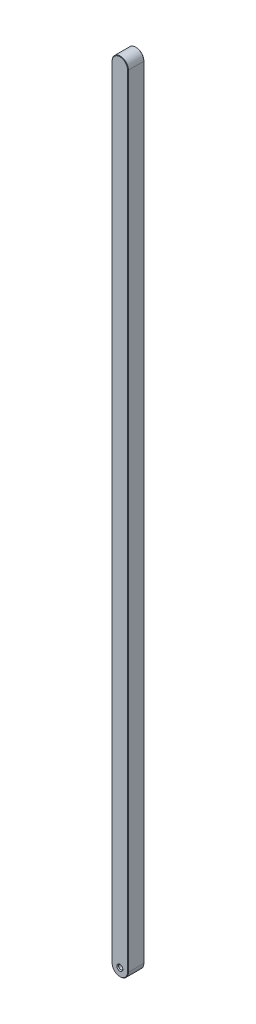
ISO-10303-21;
HEADER;
FILE_DESCRIPTION(('STEP AP214'),'2;1');
FILE_NAME('part.step','',(''),(''),'','','');
FILE_SCHEMA(('AUTOMOTIVE_DESIGN { 1 0 10303 214 1 1 1 1 }'));
ENDSEC;
DATA;
#1=APPLICATION_CONTEXT('core data for automotive mechanical design processes');
#2=APPLICATION_PROTOCOL_DEFINITION('international standard','automotive_design',2000,#1);
#3=PRODUCT_CONTEXT('',#1,'mechanical');
#4=PRODUCT('Part','Part','',(#3));
#5=PRODUCT_RELATED_PRODUCT_CATEGORY('part','',(#4));
#6=PRODUCT_DEFINITION_FORMATION('','',#4);
#7=PRODUCT_DEFINITION_CONTEXT('part definition',#1,'design');
#8=PRODUCT_DEFINITION('design','',#6,#7);
#9=PRODUCT_DEFINITION_SHAPE('','',#8);
#10=(LENGTH_UNIT() NAMED_UNIT(*) SI_UNIT(.MILLI.,.METRE.));
#11=(NAMED_UNIT(*) PLANE_ANGLE_UNIT() SI_UNIT($,.RADIAN.));
#12=(NAMED_UNIT(*) SI_UNIT($,.STERADIAN.) SOLID_ANGLE_UNIT());
#13=UNCERTAINTY_MEASURE_WITH_UNIT(LENGTH_MEASURE(1.E-05),#10,'distance_accuracy_value','');
#14=(GEOMETRIC_REPRESENTATION_CONTEXT(3) GLOBAL_UNCERTAINTY_ASSIGNED_CONTEXT((#13)) GLOBAL_UNIT_ASSIGNED_CONTEXT((#10,
#11,#12)) REPRESENTATION_CONTEXT('',''));
#15=CARTESIAN_POINT('',(0.,0.,0.));
#16=DIRECTION('',(0.,0.,1.));
#17=DIRECTION('',(1.,0.,0.));
#18=AXIS2_PLACEMENT_3D('',#15,#16,#17);
#19=CARTESIAN_POINT('',(0.,0.,4.7625));
#20=DIRECTION('',(0.,0.,-1.));
#21=DIRECTION('',(-1.,0.,0.));
#22=AXIS2_PLACEMENT_3D('',#19,#20,#21);
#23=CYLINDRICAL_SURFACE('',#22,4.7625);
#24=DIRECTION('',(0.,0.,-1.));
#25=VECTOR('',#24,1.);
#26=CARTESIAN_POINT('',(-4.7625,0.,4.7625));
#27=LINE('',#26,#25);
#28=CARTESIAN_POINT('',(-4.7625,0.,4.50850000000023));
#29=VERTEX_POINT('',#28);
#30=CARTESIAN_POINT('',(-4.7625,0.,-4.50849999999993));
#31=VERTEX_POINT('',#30);
#32=EDGE_CURVE('E129',#29,#31,#27,.T.);
#33=ORIENTED_EDGE('',*,*,#32,.T.);
#34=CARTESIAN_POINT('',(0.,0.,-4.50849999999993));
#35=DIRECTION('',(0.,0.,1.));
#36=DIRECTION('',(1.,0.,0.));
#37=AXIS2_PLACEMENT_3D('',#34,#35,#36);
#38=CIRCLE('',#37,4.7625);
#39=CARTESIAN_POINT('',(4.7625,0.,-4.50849999999993));
#40=VERTEX_POINT('',#39);
#41=EDGE_CURVE('E216',#31,#40,#38,.T.);
#42=ORIENTED_EDGE('',*,*,#41,.T.);
#43=DIRECTION('',(0.,0.,-1.));
#44=VECTOR('',#43,1.);
#45=CARTESIAN_POINT('',(4.7625,0.,4.7625));
#46=LINE('',#45,#44);
#47=CARTESIAN_POINT('',(4.7625,0.,4.50850000000023));
#48=VERTEX_POINT('',#47);
#49=EDGE_CURVE('E150',#48,#40,#46,.T.);
#50=ORIENTED_EDGE('',*,*,#49,.F.);
#51=CARTESIAN_POINT('',(0.,0.,4.50850000000023));
#52=DIRECTION('',(0.,0.,1.));
#53=DIRECTION('',(1.,0.,0.));
#54=AXIS2_PLACEMENT_3D('',#51,#52,#53);
#55=CIRCLE('',#54,4.7625);
#56=EDGE_CURVE('E214',#48,#29,#55,.F.);
#57=ORIENTED_EDGE('',*,*,#56,.T.);
#58=EDGE_LOOP('',(#33,#42,#50,#57));
#59=FACE_BOUND('',#58,.T.);
#60=ADVANCED_FACE('F53',(#59),#23,.T.);
#61=CARTESIAN_POINT('',(4.7625,0.,4.7625));
#62=DIRECTION('',(-1.,0.,0.));
#63=DIRECTION('',(0.,0.,1.));
#64=AXIS2_PLACEMENT_3D('',#61,#62,#63);
#65=PLANE('',#64);
#66=ORIENTED_EDGE('',*,*,#49,.T.);
#67=DIRECTION('',(0.,1.,0.));
#68=VECTOR('',#67,1.);
#69=CARTESIAN_POINT('',(4.7625,0.,-4.50849999999993));
#70=LINE('',#69,#68);
#71=CARTESIAN_POINT('',(4.7625,457.2,-4.50849999999993));
#72=VERTEX_POINT('',#71);
#73=EDGE_CURVE('E212',#40,#72,#70,.T.);
#74=ORIENTED_EDGE('',*,*,#73,.T.);
#75=DIRECTION('',(0.,0.,-1.));
#76=VECTOR('',#75,1.);
#77=CARTESIAN_POINT('',(4.7625,457.2,4.7625));
#78=LINE('',#77,#76);
#79=CARTESIAN_POINT('',(4.7625,457.2,4.50850000000023));
#80=VERTEX_POINT('',#79);
#81=EDGE_CURVE('E145',#80,#72,#78,.T.);
#82=ORIENTED_EDGE('',*,*,#81,.F.);
#83=DIRECTION('',(0.,-1.,0.));
#84=VECTOR('',#83,1.);
#85=CARTESIAN_POINT('',(4.7625,0.,4.50850000000023));
#86=LINE('',#85,#84);
#87=EDGE_CURVE('E210',#80,#48,#86,.T.);
#88=ORIENTED_EDGE('',*,*,#87,.T.);
#89=EDGE_LOOP('',(#66,#74,#82,#88));
#90=FACE_BOUND('',#89,.T.);
#91=ADVANCED_FACE('F228',(#90),#65,.F.);
#92=CARTESIAN_POINT('',(0.,457.2,4.7625));
#93=DIRECTION('',(0.,0.,-1.));
#94=DIRECTION('',(-1.,0.,0.));
#95=AXIS2_PLACEMENT_3D('',#92,#93,#94);
#96=CYLINDRICAL_SURFACE('',#95,4.7625);
#97=ORIENTED_EDGE('',*,*,#81,.T.);
#98=CARTESIAN_POINT('',(0.,457.2,-4.50849999999993));
#99=DIRECTION('',(0.,0.,1.));
#100=DIRECTION('',(1.,0.,0.));
#101=AXIS2_PLACEMENT_3D('',#98,#99,#100);
#102=CIRCLE('',#101,4.7625);
#103=CARTESIAN_POINT('',(-4.7625,457.2,-4.50849999999993));
#104=VERTEX_POINT('',#103);
#105=EDGE_CURVE('E144',#72,#104,#102,.T.);
#106=ORIENTED_EDGE('',*,*,#105,.T.);
#107=DIRECTION('',(0.,0.,-1.));
#108=VECTOR('',#107,1.);
#109=CARTESIAN_POINT('',(-4.7625,457.2,4.7625));
#110=LINE('',#109,#108);
#111=CARTESIAN_POINT('',(-4.7625,457.2,4.50850000000023));
#112=VERTEX_POINT('',#111);
#113=EDGE_CURVE('E127',#112,#104,#110,.T.);
#114=ORIENTED_EDGE('',*,*,#113,.F.);
#115=CARTESIAN_POINT('',(0.,457.2,4.50850000000023));
#116=DIRECTION('',(0.,0.,1.));
#117=DIRECTION('',(1.,0.,0.));
#118=AXIS2_PLACEMENT_3D('',#115,#116,#117);
#119=CIRCLE('',#118,4.7625);
#120=EDGE_CURVE('E141',#112,#80,#119,.F.);
#121=ORIENTED_EDGE('',*,*,#120,.T.);
#122=EDGE_LOOP('',(#97,#106,#114,#121));
#123=FACE_BOUND('',#122,.T.);
#124=ADVANCED_FACE('F140',(#123),#96,.T.);
#125=CARTESIAN_POINT('',(-4.7625,0.,4.7625));
#126=DIRECTION('',(1.,0.,0.));
#127=DIRECTION('',(0.,0.,-1.));
#128=AXIS2_PLACEMENT_3D('',#125,#126,#127);
#129=PLANE('',#128);
#130=ORIENTED_EDGE('',*,*,#113,.T.);
#131=DIRECTION('',(0.,-1.,0.));
#132=VECTOR('',#131,1.);
#133=CARTESIAN_POINT('',(-4.7625,0.,-4.50849999999993));
#134=LINE('',#133,#132);
#135=EDGE_CURVE('E133',#104,#31,#134,.T.);
#136=ORIENTED_EDGE('',*,*,#135,.T.);
#137=ORIENTED_EDGE('',*,*,#32,.F.);
#138=DIRECTION('',(0.,1.,0.));
#139=VECTOR('',#138,1.);
#140=CARTESIAN_POINT('',(-4.7625,457.2,4.50850000000023));
#141=LINE('',#140,#139);
#142=EDGE_CURVE('E124',#29,#112,#141,.T.);
#143=ORIENTED_EDGE('',*,*,#142,.T.);
#144=EDGE_LOOP('',(#130,#136,#137,#143));
#145=FACE_BOUND('',#144,.T.);
#146=ADVANCED_FACE('F126',(#145),#129,.F.);
#147=CARTESIAN_POINT('',(0.,0.,4.7625));
#148=DIRECTION('',(0.,0.,1.));
#149=DIRECTION('',(1.,0.,0.));
#150=AXIS2_PLACEMENT_3D('',#147,#148,#149);
#151=PLANE('',#150);
#152=DIRECTION('',(0.,1.,0.));
#153=VECTOR('',#152,1.);
#154=CARTESIAN_POINT('',(4.50850000000025,457.2,4.7625));
#155=LINE('',#154,#153);
#156=CARTESIAN_POINT('',(4.50850000000025,0.,4.7625));
#157=VERTEX_POINT('',#156);
#158=CARTESIAN_POINT('',(4.50850000000025,457.2,4.7625));
#159=VERTEX_POINT('',#158);
#160=EDGE_CURVE('E78',#157,#159,#155,.T.);
#161=ORIENTED_EDGE('',*,*,#160,.T.);
#162=CARTESIAN_POINT('',(0.,457.2,4.7625));
#163=DIRECTION('',(0.,0.,1.));
#164=DIRECTION('',(1.,0.,0.));
#165=AXIS2_PLACEMENT_3D('',#162,#163,#164);
#166=CIRCLE('',#165,4.50850000000025);
#167=CARTESIAN_POINT('',(-4.50850000000025,457.2,4.7625));
#168=VERTEX_POINT('',#167);
#169=EDGE_CURVE('E11',#159,#168,#166,.T.);
#170=ORIENTED_EDGE('',*,*,#169,.T.);
#171=DIRECTION('',(0.,-1.,0.));
#172=VECTOR('',#171,1.);
#173=CARTESIAN_POINT('',(-4.50850000000025,0.,4.7625));
#174=LINE('',#173,#172);
#175=CARTESIAN_POINT('',(-4.50850000000025,0.,4.7625));
#176=VERTEX_POINT('',#175);
#177=EDGE_CURVE('E63',#168,#176,#174,.T.);
#178=ORIENTED_EDGE('',*,*,#177,.T.);
#179=CARTESIAN_POINT('',(0.,0.,4.7625));
#180=DIRECTION('',(0.,0.,1.));
#181=DIRECTION('',(1.,0.,0.));
#182=AXIS2_PLACEMENT_3D('',#179,#180,#181);
#183=CIRCLE('',#182,4.50850000000025);
#184=EDGE_CURVE('E218',#176,#157,#183,.T.);
#185=ORIENTED_EDGE('',*,*,#184,.T.);
#186=EDGE_LOOP('',(#161,#170,#178,#185));
#187=FACE_BOUND('',#186,.T.);
#188=CARTESIAN_POINT('',(0.,0.,4.7625));
#189=DIRECTION('',(0.,0.,1.));
#190=DIRECTION('',(1.,0.,0.));
#191=AXIS2_PLACEMENT_3D('',#188,#189,#190);
#192=CIRCLE('',#191,1.75);
#193=CARTESIAN_POINT('',(1.75000000000001,0.,4.7625));
#194=VERTEX_POINT('',#193);
#195=EDGE_CURVE('E183',#194,#194,#192,.T.);
#196=ORIENTED_EDGE('',*,*,#195,.F.);
#197=EDGE_LOOP('',(#196));
#198=FACE_BOUND('',#197,.T.);
#199=ADVANCED_FACE('F221',(#187,#198),#151,.T.);
#200=CARTESIAN_POINT('',(0.,0.,-4.7625));
#201=DIRECTION('',(0.,0.,1.));
#202=DIRECTION('',(1.,0.,0.));
#203=AXIS2_PLACEMENT_3D('',#200,#201,#202);
#204=PLANE('',#203);
#205=DIRECTION('',(0.,1.,0.));
#206=VECTOR('',#205,1.);
#207=CARTESIAN_POINT('',(-4.50849999999986,0.,-4.7625));
#208=LINE('',#207,#206);
#209=CARTESIAN_POINT('',(-4.50849999999986,0.,-4.7625));
#210=VERTEX_POINT('',#209);
#211=CARTESIAN_POINT('',(-4.50849999999986,457.2,-4.7625));
#212=VERTEX_POINT('',#211);
#213=EDGE_CURVE('E205',#210,#212,#208,.T.);
#214=ORIENTED_EDGE('',*,*,#213,.T.);
#215=CARTESIAN_POINT('',(0.,457.2,-4.7625));
#216=DIRECTION('',(0.,0.,1.));
#217=DIRECTION('',(1.,0.,0.));
#218=AXIS2_PLACEMENT_3D('',#215,#216,#217);
#219=CIRCLE('',#218,4.50849999999986);
#220=CARTESIAN_POINT('',(4.50849999999986,457.2,-4.7625));
#221=VERTEX_POINT('',#220);
#222=EDGE_CURVE('E134',#212,#221,#219,.F.);
#223=ORIENTED_EDGE('',*,*,#222,.T.);
#224=DIRECTION('',(0.,-1.,0.));
#225=VECTOR('',#224,1.);
#226=CARTESIAN_POINT('',(4.50849999999986,0.,-4.7625));
#227=LINE('',#226,#225);
#228=CARTESIAN_POINT('',(4.50849999999986,0.,-4.7625));
#229=VERTEX_POINT('',#228);
#230=EDGE_CURVE('E203',#221,#229,#227,.T.);
#231=ORIENTED_EDGE('',*,*,#230,.T.);
#232=CARTESIAN_POINT('',(0.,0.,-4.7625));
#233=DIRECTION('',(0.,0.,1.));
#234=DIRECTION('',(1.,0.,0.));
#235=AXIS2_PLACEMENT_3D('',#232,#233,#234);
#236=CIRCLE('',#235,4.50849999999986);
#237=EDGE_CURVE('E201',#229,#210,#236,.F.);
#238=ORIENTED_EDGE('',*,*,#237,.T.);
#239=EDGE_LOOP('',(#214,#223,#231,#238));
#240=FACE_BOUND('',#239,.T.);
#241=CARTESIAN_POINT('',(0.,0.,-4.7625));
#242=DIRECTION('',(0.,0.,1.));
#243=DIRECTION('',(1.,0.,0.));
#244=AXIS2_PLACEMENT_3D('',#241,#242,#243);
#245=CIRCLE('',#244,1.75);
#246=CARTESIAN_POINT('',(1.75,0.,-4.7625));
#247=VERTEX_POINT('',#246);
#248=EDGE_CURVE('E177',#247,#247,#245,.T.);
#249=ORIENTED_EDGE('',*,*,#248,.T.);
#250=EDGE_LOOP('',(#249));
#251=FACE_BOUND('',#250,.T.);
#252=ADVANCED_FACE('F258',(#240,#251),#204,.F.);
#253=CARTESIAN_POINT('',(0.,0.,-4.2625));
#254=DIRECTION('',(0.,0.,-1.));
#255=DIRECTION('',(-1.,0.,0.));
#256=AXIS2_PLACEMENT_3D('',#253,#254,#255);
#257=CONICAL_SURFACE('',#256,1.25,0.785398163397447);
#258=ORIENTED_EDGE('',*,*,#248,.F.);
#259=EDGE_LOOP('',(#258));
#260=FACE_BOUND('',#259,.T.);
#261=CARTESIAN_POINT('',(0.,0.,-4.2625));
#262=DIRECTION('',(0.,0.,1.));
#263=DIRECTION('',(1.,0.,0.));
#264=AXIS2_PLACEMENT_3D('',#261,#262,#263);
#265=CIRCLE('',#264,1.25);
#266=CARTESIAN_POINT('',(1.25000000000001,0.,-4.2625));
#267=VERTEX_POINT('',#266);
#268=EDGE_CURVE('E193',#267,#267,#265,.T.);
#269=ORIENTED_EDGE('',*,*,#268,.T.);
#270=EDGE_LOOP('',(#269));
#271=FACE_BOUND('',#270,.T.);
#272=ADVANCED_FACE('F261',(#260,#271),#257,.F.);
#273=CARTESIAN_POINT('',(0.,0.,4.7625));
#274=DIRECTION('',(0.,0.,1.));
#275=DIRECTION('',(1.,0.,0.));
#276=AXIS2_PLACEMENT_3D('',#273,#274,#275);
#277=CYLINDRICAL_SURFACE('',#276,1.25);
#278=ORIENTED_EDGE('',*,*,#268,.F.);
#279=EDGE_LOOP('',(#278));
#280=FACE_BOUND('',#279,.T.);
#281=CARTESIAN_POINT('',(0.,0.,4.2625));
#282=DIRECTION('',(0.,0.,1.));
#283=DIRECTION('',(1.,0.,0.));
#284=AXIS2_PLACEMENT_3D('',#281,#282,#283);
#285=CIRCLE('',#284,1.25);
#286=CARTESIAN_POINT('',(1.25000000000001,0.,4.2625));
#287=VERTEX_POINT('',#286);
#288=EDGE_CURVE('E188',#287,#287,#285,.T.);
#289=ORIENTED_EDGE('',*,*,#288,.T.);
#290=EDGE_LOOP('',(#289));
#291=FACE_BOUND('',#290,.T.);
#292=ADVANCED_FACE('F267',(#280,#291),#277,.F.);
#293=CARTESIAN_POINT('',(0.,0.,4.7625));
#294=DIRECTION('',(0.,0.,1.));
#295=DIRECTION('',(1.,0.,0.));
#296=AXIS2_PLACEMENT_3D('',#293,#294,#295);
#297=CONICAL_SURFACE('',#296,1.75,0.785398163397447);
#298=ORIENTED_EDGE('',*,*,#288,.F.);
#299=EDGE_LOOP('',(#298));
#300=FACE_BOUND('',#299,.T.);
#301=ORIENTED_EDGE('',*,*,#195,.T.);
#302=EDGE_LOOP('',(#301));
#303=FACE_BOUND('',#302,.T.);
#304=ADVANCED_FACE('F271',(#300,#303),#297,.F.);
#305=CARTESIAN_POINT('',(0.,0.,-4.50849999999993));
#306=DIRECTION('',(0.,0.,1.));
#307=DIRECTION('',(1.,0.,0.));
#308=AXIS2_PLACEMENT_3D('',#305,#306,#307);
#309=CONICAL_SURFACE('',#308,4.7625,0.785398163397592);
#310=DIRECTION('',(-0.707106781186649,0.,0.707106781186446));
#311=VECTOR('',#310,1.);
#312=CARTESIAN_POINT('',(-4.50849999999986,0.,-4.7625));
#313=LINE('',#312,#311);
#314=EDGE_CURVE('E169',#210,#31,#313,.T.);
#315=ORIENTED_EDGE('',*,*,#314,.F.);
#316=ORIENTED_EDGE('',*,*,#237,.F.);
#317=DIRECTION('',(-0.707106781186649,0.,-0.707106781186446));
#318=VECTOR('',#317,1.);
#319=CARTESIAN_POINT('',(4.7625,0.,-4.50849999999993));
#320=LINE('',#319,#318);
#321=EDGE_CURVE('E157',#40,#229,#320,.T.);
#322=ORIENTED_EDGE('',*,*,#321,.F.);
#323=ORIENTED_EDGE('',*,*,#41,.F.);
#324=EDGE_LOOP('',(#315,#316,#322,#323));
#325=FACE_BOUND('',#324,.T.);
#326=ADVANCED_FACE('F232',(#325),#309,.T.);
#327=CARTESIAN_POINT('',(4.7625,0.,-4.50849999999993));
#328=DIRECTION('',(-0.707106781186446,0.,0.707106781186649));
#329=DIRECTION('',(0.,1.,0.));
#330=AXIS2_PLACEMENT_3D('',#327,#328,#329);
#331=PLANE('',#330);
#332=ORIENTED_EDGE('',*,*,#321,.T.);
#333=ORIENTED_EDGE('',*,*,#230,.F.);
#334=DIRECTION('',(-0.707106781186649,0.,-0.707106781186446));
#335=VECTOR('',#334,1.);
#336=CARTESIAN_POINT('',(4.7625,457.2,-4.50849999999993));
#337=LINE('',#336,#335);
#338=EDGE_CURVE('E163',#72,#221,#337,.T.);
#339=ORIENTED_EDGE('',*,*,#338,.F.);
#340=ORIENTED_EDGE('',*,*,#73,.F.);
#341=EDGE_LOOP('',(#332,#333,#339,#340));
#342=FACE_BOUND('',#341,.T.);
#343=ADVANCED_FACE('F235',(#342),#331,.F.);
#344=CARTESIAN_POINT('',(-4.7625,0.,-4.50849999999993));
#345=DIRECTION('',(0.707106781186446,0.,0.707106781186649));
#346=DIRECTION('',(0.,-1.,0.));
#347=AXIS2_PLACEMENT_3D('',#344,#345,#346);
#348=PLANE('',#347);
#349=ORIENTED_EDGE('',*,*,#314,.T.);
#350=ORIENTED_EDGE('',*,*,#135,.F.);
#351=DIRECTION('',(-0.707106781186649,0.,0.707106781186446));
#352=VECTOR('',#351,1.);
#353=CARTESIAN_POINT('',(-4.50849999999986,457.2,-4.7625));
#354=LINE('',#353,#352);
#355=EDGE_CURVE('E160',#212,#104,#354,.T.);
#356=ORIENTED_EDGE('',*,*,#355,.F.);
#357=ORIENTED_EDGE('',*,*,#213,.F.);
#358=EDGE_LOOP('',(#349,#350,#356,#357));
#359=FACE_BOUND('',#358,.T.);
#360=ADVANCED_FACE('F238',(#359),#348,.F.);
#361=CARTESIAN_POINT('',(0.,457.2,-4.50849999999993));
#362=DIRECTION('',(0.,0.,1.));
#363=DIRECTION('',(1.,0.,0.));
#364=AXIS2_PLACEMENT_3D('',#361,#362,#363);
#365=CONICAL_SURFACE('',#364,4.7625,0.785398163397592);
#366=ORIENTED_EDGE('',*,*,#338,.T.);
#367=ORIENTED_EDGE('',*,*,#222,.F.);
#368=ORIENTED_EDGE('',*,*,#355,.T.);
#369=ORIENTED_EDGE('',*,*,#105,.F.);
#370=EDGE_LOOP('',(#366,#367,#368,#369));
#371=FACE_BOUND('',#370,.T.);
#372=ADVANCED_FACE('F236',(#371),#365,.T.);
#373=CARTESIAN_POINT('',(0.,0.,4.7625));
#374=DIRECTION('',(0.,0.,-1.));
#375=DIRECTION('',(-1.,0.,0.));
#376=AXIS2_PLACEMENT_3D('',#373,#374,#375);
#377=CONICAL_SURFACE('',#376,4.50850000000025,0.785398163397416);
#378=DIRECTION('',(0.707106781186525,0.,0.707106781186571));
#379=VECTOR('',#378,1.);
#380=CARTESIAN_POINT('',(-4.7625,0.,4.50850000000023));
#381=LINE('',#380,#379);
#382=EDGE_CURVE('E154',#29,#176,#381,.T.);
#383=ORIENTED_EDGE('',*,*,#382,.F.);
#384=ORIENTED_EDGE('',*,*,#56,.F.);
#385=DIRECTION('',(0.707106781186525,0.,-0.707106781186571));
#386=VECTOR('',#385,1.);
#387=CARTESIAN_POINT('',(4.50850000000025,0.,4.7625));
#388=LINE('',#387,#386);
#389=EDGE_CURVE('E58',#157,#48,#388,.T.);
#390=ORIENTED_EDGE('',*,*,#389,.F.);
#391=ORIENTED_EDGE('',*,*,#184,.F.);
#392=EDGE_LOOP('',(#383,#384,#390,#391));
#393=FACE_BOUND('',#392,.T.);
#394=ADVANCED_FACE('F56',(#393),#377,.T.);
#395=CARTESIAN_POINT('',(4.50850000000025,0.,4.7625));
#396=DIRECTION('',(0.707106781186571,0.,0.707106781186525));
#397=DIRECTION('',(0.,-1.,0.));
#398=AXIS2_PLACEMENT_3D('',#395,#396,#397);
#399=PLANE('',#398);
#400=ORIENTED_EDGE('',*,*,#389,.T.);
#401=ORIENTED_EDGE('',*,*,#87,.F.);
#402=DIRECTION('',(0.707106781186525,0.,-0.707106781186571));
#403=VECTOR('',#402,1.);
#404=CARTESIAN_POINT('',(4.50850000000025,457.2,4.7625));
#405=LINE('',#404,#403);
#406=EDGE_CURVE('E148',#159,#80,#405,.T.);
#407=ORIENTED_EDGE('',*,*,#406,.F.);
#408=ORIENTED_EDGE('',*,*,#160,.F.);
#409=EDGE_LOOP('',(#400,#401,#407,#408));
#410=FACE_BOUND('',#409,.T.);
#411=ADVANCED_FACE('F225',(#410),#399,.T.);
#412=CARTESIAN_POINT('',(-4.50850000000025,0.,4.7625));
#413=DIRECTION('',(-0.707106781186571,0.,0.707106781186525));
#414=DIRECTION('',(0.,1.,0.));
#415=AXIS2_PLACEMENT_3D('',#412,#413,#414);
#416=PLANE('',#415);
#417=ORIENTED_EDGE('',*,*,#382,.T.);
#418=ORIENTED_EDGE('',*,*,#177,.F.);
#419=DIRECTION('',(0.707106781186525,0.,0.707106781186571));
#420=VECTOR('',#419,1.);
#421=CARTESIAN_POINT('',(-4.7625,457.2,4.50850000000023));
#422=LINE('',#421,#420);
#423=EDGE_CURVE('E71',#112,#168,#422,.T.);
#424=ORIENTED_EDGE('',*,*,#423,.F.);
#425=ORIENTED_EDGE('',*,*,#142,.F.);
#426=EDGE_LOOP('',(#417,#418,#424,#425));
#427=FACE_BOUND('',#426,.T.);
#428=ADVANCED_FACE('F152',(#427),#416,.T.);
#429=CARTESIAN_POINT('',(0.,457.2,4.7625));
#430=DIRECTION('',(0.,0.,-1.));
#431=DIRECTION('',(-1.,0.,0.));
#432=AXIS2_PLACEMENT_3D('',#429,#430,#431);
#433=CONICAL_SURFACE('',#432,4.50850000000025,0.785398163397416);
#434=ORIENTED_EDGE('',*,*,#406,.T.);
#435=ORIENTED_EDGE('',*,*,#120,.F.);
#436=ORIENTED_EDGE('',*,*,#423,.T.);
#437=ORIENTED_EDGE('',*,*,#169,.F.);
#438=EDGE_LOOP('',(#434,#435,#436,#437));
#439=FACE_BOUND('',#438,.T.);
#440=ADVANCED_FACE('F147',(#439),#433,.T.);
#441=CLOSED_SHELL('',(#60,#91,#124,#146,#199,#252,#272,#292,#304,#326,#343,#360,#372,#394,#411,
#428,#440));
#442=MANIFOLD_SOLID_BREP('B2',#441);
#443=ADVANCED_BREP_SHAPE_REPRESENTATION('',(#18,#442),#14);
#444=SHAPE_DEFINITION_REPRESENTATION(#9,#443);
ENDSEC;
END-ISO-10303-21;
